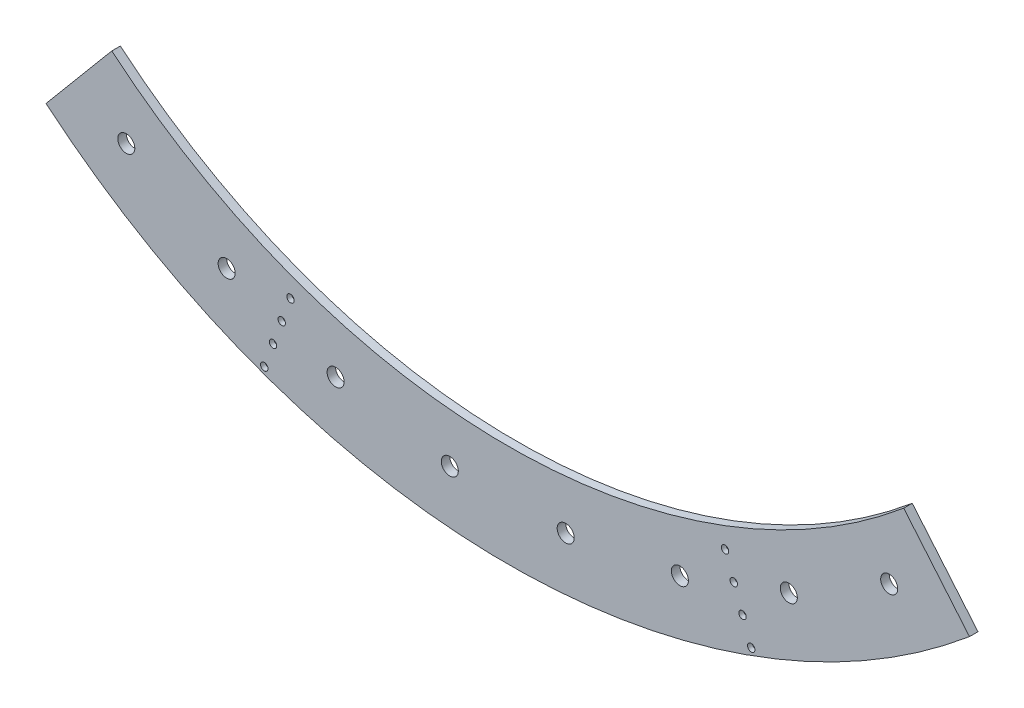
ISO-10303-21;
HEADER;
FILE_DESCRIPTION(('STEP AP214'),'2;1');
FILE_NAME('part.step','',(''),(''),'','','');
FILE_SCHEMA(('AUTOMOTIVE_DESIGN { 1 0 10303 214 1 1 1 1 }'));
ENDSEC;
DATA;
#1=APPLICATION_CONTEXT('core data for automotive mechanical design processes');
#2=APPLICATION_PROTOCOL_DEFINITION('international standard','automotive_design',2000,#1);
#3=PRODUCT_CONTEXT('',#1,'mechanical');
#4=PRODUCT('Part','Part','',(#3));
#5=PRODUCT_RELATED_PRODUCT_CATEGORY('part','',(#4));
#6=PRODUCT_DEFINITION_FORMATION('','',#4);
#7=PRODUCT_DEFINITION_CONTEXT('part definition',#1,'design');
#8=PRODUCT_DEFINITION('design','',#6,#7);
#9=PRODUCT_DEFINITION_SHAPE('','',#8);
#10=(LENGTH_UNIT() NAMED_UNIT(*) SI_UNIT(.MILLI.,.METRE.));
#11=(NAMED_UNIT(*) PLANE_ANGLE_UNIT() SI_UNIT($,.RADIAN.));
#12=(NAMED_UNIT(*) SI_UNIT($,.STERADIAN.) SOLID_ANGLE_UNIT());
#13=UNCERTAINTY_MEASURE_WITH_UNIT(LENGTH_MEASURE(1.E-05),#10,'distance_accuracy_value','');
#14=(GEOMETRIC_REPRESENTATION_CONTEXT(3) GLOBAL_UNCERTAINTY_ASSIGNED_CONTEXT((#13)) GLOBAL_UNIT_ASSIGNED_CONTEXT((#10,
#11,#12)) REPRESENTATION_CONTEXT('',''));
#15=CARTESIAN_POINT('',(0.,0.,0.));
#16=DIRECTION('',(0.,0.,1.));
#17=DIRECTION('',(1.,0.,0.));
#18=AXIS2_PLACEMENT_3D('',#15,#16,#17);
#19=CARTESIAN_POINT('',(0.,0.,12.7));
#20=DIRECTION('',(0.,0.,-1.));
#21=DIRECTION('',(-1.,0.,0.));
#22=AXIS2_PLACEMENT_3D('',#19,#20,#21);
#23=CYLINDRICAL_SURFACE('',#22,917.575);
#24=CARTESIAN_POINT('',(0.,0.,0.));
#25=DIRECTION('',(0.,0.,-1.));
#26=DIRECTION('',(1.,0.,0.));
#27=AXIS2_PLACEMENT_3D('',#24,#25,#26);
#28=CIRCLE('',#27,917.575);
#29=CARTESIAN_POINT('',(589.805840958127,-702.903229894895,0.));
#30=VERTEX_POINT('',#29);
#31=CARTESIAN_POINT('',(-589.805840958127,-702.903229894895,0.));
#32=VERTEX_POINT('',#31);
#33=EDGE_CURVE('E111',#30,#32,#28,.T.);
#34=ORIENTED_EDGE('',*,*,#33,.T.);
#35=DIRECTION('',(0.,0.,-1.));
#36=VECTOR('',#35,1.);
#37=CARTESIAN_POINT('',(-589.805840958127,-702.903229894895,12.7));
#38=LINE('',#37,#36);
#39=CARTESIAN_POINT('',(-589.805840958127,-702.903229894895,12.7));
#40=VERTEX_POINT('',#39);
#41=EDGE_CURVE('E13',#40,#32,#38,.T.);
#42=ORIENTED_EDGE('',*,*,#41,.F.);
#43=CARTESIAN_POINT('',(0.,0.,12.7));
#44=DIRECTION('',(0.,0.,-1.));
#45=DIRECTION('',(1.,0.,0.));
#46=AXIS2_PLACEMENT_3D('',#43,#44,#45);
#47=CIRCLE('',#46,917.575);
#48=CARTESIAN_POINT('',(589.805840958127,-702.903229894895,12.7));
#49=VERTEX_POINT('',#48);
#50=EDGE_CURVE('E99',#49,#40,#47,.T.);
#51=ORIENTED_EDGE('',*,*,#50,.F.);
#52=DIRECTION('',(0.,0.,-1.));
#53=VECTOR('',#52,1.);
#54=CARTESIAN_POINT('',(589.805840958127,-702.903229894895,12.7));
#55=LINE('',#54,#53);
#56=EDGE_CURVE('E107',#49,#30,#55,.T.);
#57=ORIENTED_EDGE('',*,*,#56,.T.);
#58=EDGE_LOOP('',(#34,#42,#51,#57));
#59=FACE_BOUND('',#58,.T.);
#60=ADVANCED_FACE('F48',(#59),#23,.F.);
#61=CARTESIAN_POINT('',(-589.805840958127,-702.903229894895,12.7));
#62=DIRECTION('',(0.766044443118978,-0.64278760968654,0.));
#63=DIRECTION('',(0.64278760968654,0.766044443118978,0.));
#64=AXIS2_PLACEMENT_3D('',#61,#62,#63);
#65=PLANE('',#64);
#66=DIRECTION('',(-0.64278760968654,-0.766044443118978,0.));
#67=VECTOR('',#66,1.);
#68=CARTESIAN_POINT('',(-589.805840958127,-702.903229894895,0.));
#69=LINE('',#68,#67);
#70=CARTESIAN_POINT('',(-687.766672674356,-819.648403026228,0.));
#71=VERTEX_POINT('',#70);
#72=EDGE_CURVE('E103',#32,#71,#69,.T.);
#73=ORIENTED_EDGE('',*,*,#72,.T.);
#74=DIRECTION('',(0.,0.,-1.));
#75=VECTOR('',#74,1.);
#76=CARTESIAN_POINT('',(-687.766672674356,-819.648403026228,12.7));
#77=LINE('',#76,#75);
#78=CARTESIAN_POINT('',(-687.766672674356,-819.648403026228,12.7));
#79=VERTEX_POINT('',#78);
#80=EDGE_CURVE('E56',#79,#71,#77,.T.);
#81=ORIENTED_EDGE('',*,*,#80,.F.);
#82=DIRECTION('',(-0.64278760968654,-0.766044443118978,0.));
#83=VECTOR('',#82,1.);
#84=CARTESIAN_POINT('',(-589.805840958127,-702.903229894895,12.7));
#85=LINE('',#84,#83);
#86=EDGE_CURVE('E94',#40,#79,#85,.T.);
#87=ORIENTED_EDGE('',*,*,#86,.F.);
#88=ORIENTED_EDGE('',*,*,#41,.T.);
#89=EDGE_LOOP('',(#73,#81,#87,#88));
#90=FACE_BOUND('',#89,.T.);
#91=ADVANCED_FACE('F102',(#90),#65,.F.);
#92=CARTESIAN_POINT('',(0.,0.,12.7));
#93=DIRECTION('',(0.,0.,-1.));
#94=DIRECTION('',(-1.,0.,0.));
#95=AXIS2_PLACEMENT_3D('',#92,#93,#94);
#96=CYLINDRICAL_SURFACE('',#95,1069.975);
#97=CARTESIAN_POINT('',(0.,0.,0.));
#98=DIRECTION('',(0.,0.,1.));
#99=DIRECTION('',(1.,0.,0.));
#100=AXIS2_PLACEMENT_3D('',#97,#98,#99);
#101=CIRCLE('',#100,1069.975);
#102=CARTESIAN_POINT('',(687.766672674356,-819.648403026228,0.));
#103=VERTEX_POINT('',#102);
#104=EDGE_CURVE('E81',#71,#103,#101,.T.);
#105=ORIENTED_EDGE('',*,*,#104,.T.);
#106=DIRECTION('',(0.,0.,-1.));
#107=VECTOR('',#106,1.);
#108=CARTESIAN_POINT('',(687.766672674356,-819.648403026228,12.7));
#109=LINE('',#108,#107);
#110=CARTESIAN_POINT('',(687.766672674356,-819.648403026228,12.7));
#111=VERTEX_POINT('',#110);
#112=EDGE_CURVE('E104',#111,#103,#109,.T.);
#113=ORIENTED_EDGE('',*,*,#112,.F.);
#114=CARTESIAN_POINT('',(0.,0.,12.7));
#115=DIRECTION('',(0.,0.,1.));
#116=DIRECTION('',(1.,0.,0.));
#117=AXIS2_PLACEMENT_3D('',#114,#115,#116);
#118=CIRCLE('',#117,1069.975);
#119=EDGE_CURVE('E97',#79,#111,#118,.T.);
#120=ORIENTED_EDGE('',*,*,#119,.F.);
#121=ORIENTED_EDGE('',*,*,#80,.T.);
#122=EDGE_LOOP('',(#105,#113,#120,#121));
#123=FACE_BOUND('',#122,.T.);
#124=ADVANCED_FACE('F105',(#123),#96,.T.);
#125=CARTESIAN_POINT('',(589.805840958127,-702.903229894895,12.7));
#126=DIRECTION('',(-0.766044443118978,-0.64278760968654,0.));
#127=DIRECTION('',(0.64278760968654,-0.766044443118978,0.));
#128=AXIS2_PLACEMENT_3D('',#125,#126,#127);
#129=PLANE('',#128);
#130=DIRECTION('',(-0.64278760968654,0.766044443118978,0.));
#131=VECTOR('',#130,1.);
#132=CARTESIAN_POINT('',(589.805840958127,-702.903229894895,0.));
#133=LINE('',#132,#131);
#134=EDGE_CURVE('E87',#103,#30,#133,.T.);
#135=ORIENTED_EDGE('',*,*,#134,.T.);
#136=ORIENTED_EDGE('',*,*,#56,.F.);
#137=DIRECTION('',(-0.64278760968654,0.766044443118978,0.));
#138=VECTOR('',#137,1.);
#139=CARTESIAN_POINT('',(589.805840958127,-702.903229894895,12.7));
#140=LINE('',#139,#138);
#141=EDGE_CURVE('E64',#111,#49,#140,.T.);
#142=ORIENTED_EDGE('',*,*,#141,.F.);
#143=ORIENTED_EDGE('',*,*,#112,.T.);
#144=EDGE_LOOP('',(#135,#136,#142,#143));
#145=FACE_BOUND('',#144,.T.);
#146=ADVANCED_FACE('F119',(#145),#129,.F.);
#147=CARTESIAN_POINT('',(0.,0.,12.7));
#148=DIRECTION('',(0.,0.,1.));
#149=DIRECTION('',(1.,0.,0.));
#150=AXIS2_PLACEMENT_3D('',#147,#148,#149);
#151=PLANE('',#150);
#152=CARTESIAN_POINT('',(362.695260989706,-996.497039712416,12.7));
#153=DIRECTION('',(0.,0.,1.));
#154=DIRECTION('',(1.,0.,0.));
#155=AXIS2_PLACEMENT_3D('',#152,#153,#154);
#156=CIRCLE('',#155,5.55624999999998);
#157=CARTESIAN_POINT('',(368.251510989706,-996.497039712416,12.7));
#158=VERTEX_POINT('',#157);
#159=EDGE_CURVE('E265',#158,#158,#156,.T.);
#160=ORIENTED_EDGE('',*,*,#159,.F.);
#161=EDGE_LOOP('',(#160));
#162=FACE_BOUND('',#161,.T.);
#163=CARTESIAN_POINT('',(336.63332606829,-924.89246200853,12.7));
#164=DIRECTION('',(0.,0.,1.));
#165=DIRECTION('',(1.,0.,0.));
#166=AXIS2_PLACEMENT_3D('',#163,#164,#165);
#167=CIRCLE('',#166,5.55624999999998);
#168=CARTESIAN_POINT('',(342.18957606829,-924.89246200853,12.7));
#169=VERTEX_POINT('',#168);
#170=EDGE_CURVE('E253',#169,#169,#167,.T.);
#171=ORIENTED_EDGE('',*,*,#170,.F.);
#172=EDGE_LOOP('',(#171));
#173=FACE_BOUND('',#172,.T.);
#174=CARTESIAN_POINT('',(323.602358607582,-889.090173156587,12.7));
#175=DIRECTION('',(0.,0.,1.));
#176=DIRECTION('',(1.,0.,0.));
#177=AXIS2_PLACEMENT_3D('',#174,#175,#176);
#178=CIRCLE('',#177,5.55624999999998);
#179=CARTESIAN_POINT('',(329.158608607582,-889.090173156587,12.7));
#180=VERTEX_POINT('',#179);
#181=EDGE_CURVE('E241',#180,#180,#178,.T.);
#182=ORIENTED_EDGE('',*,*,#181,.F.);
#183=EDGE_LOOP('',(#182));
#184=FACE_BOUND('',#183,.T.);
#185=CARTESIAN_POINT('',(349.664293528998,-960.694750860473,12.7));
#186=DIRECTION('',(0.,0.,1.));
#187=DIRECTION('',(1.,0.,0.));
#188=AXIS2_PLACEMENT_3D('',#185,#186,#187);
#189=CIRCLE('',#188,5.55624999999998);
#190=CARTESIAN_POINT('',(355.220543528998,-960.694750860473,12.7));
#191=VERTEX_POINT('',#190);
#192=EDGE_CURVE('E229',#191,#191,#189,.T.);
#193=ORIENTED_EDGE('',*,*,#192,.F.);
#194=EDGE_LOOP('',(#193));
#195=FACE_BOUND('',#194,.T.);
#196=CARTESIAN_POINT('',(-323.602358607582,-889.090173156587,12.7));
#197=DIRECTION('',(0.,0.,1.));
#198=DIRECTION('',(1.,0.,0.));
#199=AXIS2_PLACEMENT_3D('',#196,#197,#198);
#200=CIRCLE('',#199,5.55624999999998);
#201=CARTESIAN_POINT('',(-318.046108607582,-889.090173156587,12.7));
#202=VERTEX_POINT('',#201);
#203=EDGE_CURVE('E217',#202,#202,#200,.T.);
#204=ORIENTED_EDGE('',*,*,#203,.F.);
#205=EDGE_LOOP('',(#204));
#206=FACE_BOUND('',#205,.T.);
#207=CARTESIAN_POINT('',(-336.63332606829,-924.89246200853,12.7));
#208=DIRECTION('',(0.,0.,1.));
#209=DIRECTION('',(1.,0.,0.));
#210=AXIS2_PLACEMENT_3D('',#207,#208,#209);
#211=CIRCLE('',#210,5.55624999999998);
#212=CARTESIAN_POINT('',(-331.07707606829,-924.89246200853,12.7));
#213=VERTEX_POINT('',#212);
#214=EDGE_CURVE('E205',#213,#213,#211,.T.);
#215=ORIENTED_EDGE('',*,*,#214,.F.);
#216=EDGE_LOOP('',(#215));
#217=FACE_BOUND('',#216,.T.);
#218=CARTESIAN_POINT('',(-349.664293528998,-960.694750860473,12.7));
#219=DIRECTION('',(0.,0.,1.));
#220=DIRECTION('',(1.,0.,0.));
#221=AXIS2_PLACEMENT_3D('',#218,#219,#220);
#222=CIRCLE('',#221,5.55624999999998);
#223=CARTESIAN_POINT('',(-344.108043528998,-960.694750860473,12.7));
#224=VERTEX_POINT('',#223);
#225=EDGE_CURVE('E193',#224,#224,#222,.T.);
#226=ORIENTED_EDGE('',*,*,#225,.F.);
#227=EDGE_LOOP('',(#226));
#228=FACE_BOUND('',#227,.T.);
#229=CARTESIAN_POINT('',(-362.695260989706,-996.497039712416,12.7));
#230=DIRECTION('',(0.,0.,1.));
#231=DIRECTION('',(1.,0.,0.));
#232=AXIS2_PLACEMENT_3D('',#229,#230,#231);
#233=CIRCLE('',#232,5.55624999999998);
#234=CARTESIAN_POINT('',(-357.139010989706,-996.497039712416,12.7));
#235=VERTEX_POINT('',#234);
#236=EDGE_CURVE('E181',#235,#235,#233,.T.);
#237=ORIENTED_EDGE('',*,*,#236,.F.);
#238=EDGE_LOOP('',(#237));
#239=FACE_BOUND('',#238,.T.);
#240=CARTESIAN_POINT('',(568.184817849347,-811.452015072674,12.7));
#241=DIRECTION('',(0.,0.,1.));
#242=DIRECTION('',(1.,0.,0.));
#243=AXIS2_PLACEMENT_3D('',#240,#241,#242);
#244=CIRCLE('',#243,12.7);
#245=CARTESIAN_POINT('',(580.884817849347,-811.452015072674,12.7));
#246=VERTEX_POINT('',#245);
#247=EDGE_CURVE('E169',#246,#246,#244,.T.);
#248=ORIENTED_EDGE('',*,*,#247,.F.);
#249=EDGE_LOOP('',(#248));
#250=FACE_BOUND('',#249,.T.);
#251=CARTESIAN_POINT('',(-418.645650080338,-897.788493838505,12.7));
#252=DIRECTION('',(0.,0.,1.));
#253=DIRECTION('',(1.,0.,0.));
#254=AXIS2_PLACEMENT_3D('',#251,#252,#253);
#255=CIRCLE('',#254,12.7);
#256=CARTESIAN_POINT('',(-405.945650080338,-897.788493838505,12.7));
#257=VERTEX_POINT('',#256);
#258=EDGE_CURVE('E163',#257,#257,#255,.T.);
#259=ORIENTED_EDGE('',*,*,#258,.F.);
#260=EDGE_LOOP('',(#259));
#261=FACE_BOUND('',#260,.T.);
#262=CARTESIAN_POINT('',(418.645650080338,-897.788493838505,12.7));
#263=DIRECTION('',(0.,0.,1.));
#264=DIRECTION('',(1.,0.,0.));
#265=AXIS2_PLACEMENT_3D('',#262,#263,#264);
#266=CIRCLE('',#265,12.7);
#267=CARTESIAN_POINT('',(431.345650080338,-897.788493838505,12.7));
#268=VERTEX_POINT('',#267);
#269=EDGE_CURVE('E157',#268,#268,#266,.T.);
#270=ORIENTED_EDGE('',*,*,#269,.F.);
#271=EDGE_LOOP('',(#270));
#272=FACE_BOUND('',#271,.T.);
#273=CARTESIAN_POINT('',(-568.184817849347,-811.452015072674,12.7));
#274=DIRECTION('',(0.,0.,1.));
#275=DIRECTION('',(1.,0.,0.));
#276=AXIS2_PLACEMENT_3D('',#273,#274,#275);
#277=CIRCLE('',#276,12.7);
#278=CARTESIAN_POINT('',(-555.484817849347,-811.452015072674,12.7));
#279=VERTEX_POINT('',#278);
#280=EDGE_CURVE('E151',#279,#279,#277,.T.);
#281=ORIENTED_EDGE('',*,*,#280,.F.);
#282=EDGE_LOOP('',(#281));
#283=FACE_BOUND('',#282,.T.);
#284=CARTESIAN_POINT('',(256.386146078558,-956.846123521951,12.7));
#285=DIRECTION('',(0.,0.,1.));
#286=DIRECTION('',(1.,0.,0.));
#287=AXIS2_PLACEMENT_3D('',#284,#285,#286);
#288=CIRCLE('',#287,12.7);
#289=CARTESIAN_POINT('',(269.086146078558,-956.846123521951,12.7));
#290=VERTEX_POINT('',#289);
#291=EDGE_CURVE('E145',#290,#290,#288,.T.);
#292=ORIENTED_EDGE('',*,*,#291,.F.);
#293=EDGE_LOOP('',(#292));
#294=FACE_BOUND('',#293,.T.);
#295=CARTESIAN_POINT('',(86.3364787658303,-986.830467929683,12.7));
#296=DIRECTION('',(0.,0.,1.));
#297=DIRECTION('',(1.,0.,0.));
#298=AXIS2_PLACEMENT_3D('',#295,#296,#297);
#299=CIRCLE('',#298,12.7);
#300=CARTESIAN_POINT('',(99.0364787658303,-986.830467929683,12.7));
#301=VERTEX_POINT('',#300);
#302=EDGE_CURVE('E139',#301,#301,#299,.T.);
#303=ORIENTED_EDGE('',*,*,#302,.F.);
#304=EDGE_LOOP('',(#303));
#305=FACE_BOUND('',#304,.T.);
#306=CARTESIAN_POINT('',(-86.3364787658303,-986.830467929683,12.7));
#307=DIRECTION('',(0.,0.,1.));
#308=DIRECTION('',(1.,0.,0.));
#309=AXIS2_PLACEMENT_3D('',#306,#307,#308);
#310=CIRCLE('',#309,12.7);
#311=CARTESIAN_POINT('',(-73.6364787658303,-986.830467929683,12.7));
#312=VERTEX_POINT('',#311);
#313=EDGE_CURVE('E133',#312,#312,#310,.T.);
#314=ORIENTED_EDGE('',*,*,#313,.F.);
#315=EDGE_LOOP('',(#314));
#316=FACE_BOUND('',#315,.T.);
#317=CARTESIAN_POINT('',(-256.386146078558,-956.846123521951,12.7));
#318=DIRECTION('',(0.,0.,1.));
#319=DIRECTION('',(1.,0.,0.));
#320=AXIS2_PLACEMENT_3D('',#317,#318,#319);
#321=CIRCLE('',#320,12.7);
#322=CARTESIAN_POINT('',(-243.686146078558,-956.846123521951,12.7));
#323=VERTEX_POINT('',#322);
#324=EDGE_CURVE('E127',#323,#323,#321,.T.);
#325=ORIENTED_EDGE('',*,*,#324,.F.);
#326=EDGE_LOOP('',(#325));
#327=FACE_BOUND('',#326,.T.);
#328=ORIENTED_EDGE('',*,*,#50,.T.);
#329=ORIENTED_EDGE('',*,*,#86,.T.);
#330=ORIENTED_EDGE('',*,*,#119,.T.);
#331=ORIENTED_EDGE('',*,*,#141,.T.);
#332=EDGE_LOOP('',(#328,#329,#330,#331));
#333=FACE_BOUND('',#332,.T.);
#334=ADVANCED_FACE('F95',(#162,#173,#184,#195,#206,#217,#228,#239,#250,#261,#272,#283,#294,#305,
#316,#327,#333),#151,.T.);
#335=CARTESIAN_POINT('',(0.,0.,0.));
#336=DIRECTION('',(0.,0.,1.));
#337=DIRECTION('',(1.,0.,0.));
#338=AXIS2_PLACEMENT_3D('',#335,#336,#337);
#339=PLANE('',#338);
#340=CARTESIAN_POINT('',(362.695260989706,-996.497039712416,0.));
#341=DIRECTION('',(0.,0.,1.));
#342=DIRECTION('',(1.,0.,0.));
#343=AXIS2_PLACEMENT_3D('',#340,#341,#342);
#344=CIRCLE('',#343,3.26389999999999);
#345=CARTESIAN_POINT('',(365.959160989706,-996.497039712416,0.));
#346=VERTEX_POINT('',#345);
#347=EDGE_CURVE('E256',#346,#346,#344,.T.);
#348=ORIENTED_EDGE('',*,*,#347,.T.);
#349=EDGE_LOOP('',(#348));
#350=FACE_BOUND('',#349,.T.);
#351=CARTESIAN_POINT('',(336.63332606829,-924.89246200853,0.));
#352=DIRECTION('',(0.,0.,1.));
#353=DIRECTION('',(1.,0.,0.));
#354=AXIS2_PLACEMENT_3D('',#351,#352,#353);
#355=CIRCLE('',#354,3.26389999999999);
#356=CARTESIAN_POINT('',(339.89722606829,-924.89246200853,0.));
#357=VERTEX_POINT('',#356);
#358=EDGE_CURVE('E244',#357,#357,#355,.T.);
#359=ORIENTED_EDGE('',*,*,#358,.T.);
#360=EDGE_LOOP('',(#359));
#361=FACE_BOUND('',#360,.T.);
#362=CARTESIAN_POINT('',(323.602358607582,-889.090173156587,0.));
#363=DIRECTION('',(0.,0.,1.));
#364=DIRECTION('',(1.,0.,0.));
#365=AXIS2_PLACEMENT_3D('',#362,#363,#364);
#366=CIRCLE('',#365,3.26389999999999);
#367=CARTESIAN_POINT('',(326.866258607582,-889.090173156587,0.));
#368=VERTEX_POINT('',#367);
#369=EDGE_CURVE('E232',#368,#368,#366,.T.);
#370=ORIENTED_EDGE('',*,*,#369,.T.);
#371=EDGE_LOOP('',(#370));
#372=FACE_BOUND('',#371,.T.);
#373=CARTESIAN_POINT('',(349.664293528998,-960.694750860473,0.));
#374=DIRECTION('',(0.,0.,1.));
#375=DIRECTION('',(1.,0.,0.));
#376=AXIS2_PLACEMENT_3D('',#373,#374,#375);
#377=CIRCLE('',#376,3.26389999999999);
#378=CARTESIAN_POINT('',(352.928193528998,-960.694750860473,0.));
#379=VERTEX_POINT('',#378);
#380=EDGE_CURVE('E220',#379,#379,#377,.T.);
#381=ORIENTED_EDGE('',*,*,#380,.T.);
#382=EDGE_LOOP('',(#381));
#383=FACE_BOUND('',#382,.T.);
#384=CARTESIAN_POINT('',(-323.602358607582,-889.090173156587,0.));
#385=DIRECTION('',(0.,0.,1.));
#386=DIRECTION('',(1.,0.,0.));
#387=AXIS2_PLACEMENT_3D('',#384,#385,#386);
#388=CIRCLE('',#387,3.26389999999999);
#389=CARTESIAN_POINT('',(-320.338458607582,-889.090173156587,0.));
#390=VERTEX_POINT('',#389);
#391=EDGE_CURVE('E208',#390,#390,#388,.T.);
#392=ORIENTED_EDGE('',*,*,#391,.T.);
#393=EDGE_LOOP('',(#392));
#394=FACE_BOUND('',#393,.T.);
#395=CARTESIAN_POINT('',(-336.63332606829,-924.89246200853,0.));
#396=DIRECTION('',(0.,0.,1.));
#397=DIRECTION('',(1.,0.,0.));
#398=AXIS2_PLACEMENT_3D('',#395,#396,#397);
#399=CIRCLE('',#398,3.26389999999999);
#400=CARTESIAN_POINT('',(-333.36942606829,-924.89246200853,0.));
#401=VERTEX_POINT('',#400);
#402=EDGE_CURVE('E196',#401,#401,#399,.T.);
#403=ORIENTED_EDGE('',*,*,#402,.T.);
#404=EDGE_LOOP('',(#403));
#405=FACE_BOUND('',#404,.T.);
#406=CARTESIAN_POINT('',(-349.664293528998,-960.694750860473,0.));
#407=DIRECTION('',(0.,0.,1.));
#408=DIRECTION('',(1.,0.,0.));
#409=AXIS2_PLACEMENT_3D('',#406,#407,#408);
#410=CIRCLE('',#409,3.26389999999999);
#411=CARTESIAN_POINT('',(-346.400393528998,-960.694750860473,0.));
#412=VERTEX_POINT('',#411);
#413=EDGE_CURVE('E184',#412,#412,#410,.T.);
#414=ORIENTED_EDGE('',*,*,#413,.T.);
#415=EDGE_LOOP('',(#414));
#416=FACE_BOUND('',#415,.T.);
#417=CARTESIAN_POINT('',(-362.695260989706,-996.497039712416,0.));
#418=DIRECTION('',(0.,0.,1.));
#419=DIRECTION('',(1.,0.,0.));
#420=AXIS2_PLACEMENT_3D('',#417,#418,#419);
#421=CIRCLE('',#420,3.26389999999999);
#422=CARTESIAN_POINT('',(-359.431360989706,-996.497039712416,0.));
#423=VERTEX_POINT('',#422);
#424=EDGE_CURVE('E172',#423,#423,#421,.T.);
#425=ORIENTED_EDGE('',*,*,#424,.T.);
#426=EDGE_LOOP('',(#425));
#427=FACE_BOUND('',#426,.T.);
#428=CARTESIAN_POINT('',(568.184817849347,-811.452015072674,0.));
#429=DIRECTION('',(0.,0.,1.));
#430=DIRECTION('',(1.,0.,0.));
#431=AXIS2_PLACEMENT_3D('',#428,#429,#430);
#432=CIRCLE('',#431,12.7);
#433=CARTESIAN_POINT('',(580.884817849347,-811.452015072674,0.));
#434=VERTEX_POINT('',#433);
#435=EDGE_CURVE('E166',#434,#434,#432,.T.);
#436=ORIENTED_EDGE('',*,*,#435,.T.);
#437=EDGE_LOOP('',(#436));
#438=FACE_BOUND('',#437,.T.);
#439=CARTESIAN_POINT('',(-418.645650080338,-897.788493838505,0.));
#440=DIRECTION('',(0.,0.,1.));
#441=DIRECTION('',(1.,0.,0.));
#442=AXIS2_PLACEMENT_3D('',#439,#440,#441);
#443=CIRCLE('',#442,12.7);
#444=CARTESIAN_POINT('',(-405.945650080338,-897.788493838505,0.));
#445=VERTEX_POINT('',#444);
#446=EDGE_CURVE('E160',#445,#445,#443,.T.);
#447=ORIENTED_EDGE('',*,*,#446,.T.);
#448=EDGE_LOOP('',(#447));
#449=FACE_BOUND('',#448,.T.);
#450=CARTESIAN_POINT('',(418.645650080338,-897.788493838505,0.));
#451=DIRECTION('',(0.,0.,1.));
#452=DIRECTION('',(1.,0.,0.));
#453=AXIS2_PLACEMENT_3D('',#450,#451,#452);
#454=CIRCLE('',#453,12.7);
#455=CARTESIAN_POINT('',(431.345650080338,-897.788493838505,0.));
#456=VERTEX_POINT('',#455);
#457=EDGE_CURVE('E154',#456,#456,#454,.T.);
#458=ORIENTED_EDGE('',*,*,#457,.T.);
#459=EDGE_LOOP('',(#458));
#460=FACE_BOUND('',#459,.T.);
#461=CARTESIAN_POINT('',(-568.184817849347,-811.452015072674,0.));
#462=DIRECTION('',(0.,0.,1.));
#463=DIRECTION('',(1.,0.,0.));
#464=AXIS2_PLACEMENT_3D('',#461,#462,#463);
#465=CIRCLE('',#464,12.7);
#466=CARTESIAN_POINT('',(-555.484817849347,-811.452015072674,0.));
#467=VERTEX_POINT('',#466);
#468=EDGE_CURVE('E148',#467,#467,#465,.T.);
#469=ORIENTED_EDGE('',*,*,#468,.T.);
#470=EDGE_LOOP('',(#469));
#471=FACE_BOUND('',#470,.T.);
#472=CARTESIAN_POINT('',(256.386146078558,-956.846123521951,0.));
#473=DIRECTION('',(0.,0.,1.));
#474=DIRECTION('',(1.,0.,0.));
#475=AXIS2_PLACEMENT_3D('',#472,#473,#474);
#476=CIRCLE('',#475,12.7);
#477=CARTESIAN_POINT('',(269.086146078558,-956.846123521951,0.));
#478=VERTEX_POINT('',#477);
#479=EDGE_CURVE('E142',#478,#478,#476,.T.);
#480=ORIENTED_EDGE('',*,*,#479,.T.);
#481=EDGE_LOOP('',(#480));
#482=FACE_BOUND('',#481,.T.);
#483=CARTESIAN_POINT('',(86.3364787658303,-986.830467929683,0.));
#484=DIRECTION('',(0.,0.,1.));
#485=DIRECTION('',(1.,0.,0.));
#486=AXIS2_PLACEMENT_3D('',#483,#484,#485);
#487=CIRCLE('',#486,12.7);
#488=CARTESIAN_POINT('',(99.0364787658303,-986.830467929683,0.));
#489=VERTEX_POINT('',#488);
#490=EDGE_CURVE('E136',#489,#489,#487,.T.);
#491=ORIENTED_EDGE('',*,*,#490,.T.);
#492=EDGE_LOOP('',(#491));
#493=FACE_BOUND('',#492,.T.);
#494=CARTESIAN_POINT('',(-86.3364787658303,-986.830467929683,0.));
#495=DIRECTION('',(0.,0.,1.));
#496=DIRECTION('',(1.,0.,0.));
#497=AXIS2_PLACEMENT_3D('',#494,#495,#496);
#498=CIRCLE('',#497,12.7);
#499=CARTESIAN_POINT('',(-73.6364787658303,-986.830467929683,0.));
#500=VERTEX_POINT('',#499);
#501=EDGE_CURVE('E130',#500,#500,#498,.T.);
#502=ORIENTED_EDGE('',*,*,#501,.T.);
#503=EDGE_LOOP('',(#502));
#504=FACE_BOUND('',#503,.T.);
#505=CARTESIAN_POINT('',(-256.386146078558,-956.846123521951,0.));
#506=DIRECTION('',(0.,0.,1.));
#507=DIRECTION('',(1.,0.,0.));
#508=AXIS2_PLACEMENT_3D('',#505,#506,#507);
#509=CIRCLE('',#508,12.7);
#510=CARTESIAN_POINT('',(-243.686146078558,-956.846123521951,0.));
#511=VERTEX_POINT('',#510);
#512=EDGE_CURVE('E114',#511,#511,#509,.T.);
#513=ORIENTED_EDGE('',*,*,#512,.T.);
#514=EDGE_LOOP('',(#513));
#515=FACE_BOUND('',#514,.T.);
#516=ORIENTED_EDGE('',*,*,#33,.F.);
#517=ORIENTED_EDGE('',*,*,#134,.F.);
#518=ORIENTED_EDGE('',*,*,#104,.F.);
#519=ORIENTED_EDGE('',*,*,#72,.F.);
#520=EDGE_LOOP('',(#516,#517,#518,#519));
#521=FACE_BOUND('',#520,.T.);
#522=ADVANCED_FACE('F122',(#350,#361,#372,#383,#394,#405,#416,#427,#438,#449,#460,#471,#482,
#493,#504,#515,#521),#339,.F.);
#523=CARTESIAN_POINT('',(-256.386146078558,-956.846123521951,12.7));
#524=DIRECTION('',(0.,0.,1.));
#525=DIRECTION('',(1.,0.,0.));
#526=AXIS2_PLACEMENT_3D('',#523,#524,#525);
#527=CYLINDRICAL_SURFACE('',#526,12.7);
#528=ORIENTED_EDGE('',*,*,#512,.F.);
#529=EDGE_LOOP('',(#528));
#530=FACE_BOUND('',#529,.T.);
#531=ORIENTED_EDGE('',*,*,#324,.T.);
#532=EDGE_LOOP('',(#531));
#533=FACE_BOUND('',#532,.T.);
#534=ADVANCED_FACE('F304',(#530,#533),#527,.F.);
#535=CARTESIAN_POINT('',(-86.3364787658303,-986.830467929683,12.7));
#536=DIRECTION('',(0.,0.,1.));
#537=DIRECTION('',(1.,0.,0.));
#538=AXIS2_PLACEMENT_3D('',#535,#536,#537);
#539=CYLINDRICAL_SURFACE('',#538,12.7);
#540=ORIENTED_EDGE('',*,*,#501,.F.);
#541=EDGE_LOOP('',(#540));
#542=FACE_BOUND('',#541,.T.);
#543=ORIENTED_EDGE('',*,*,#313,.T.);
#544=EDGE_LOOP('',(#543));
#545=FACE_BOUND('',#544,.T.);
#546=ADVANCED_FACE('F306',(#542,#545),#539,.F.);
#547=CARTESIAN_POINT('',(86.3364787658303,-986.830467929683,12.7));
#548=DIRECTION('',(0.,0.,1.));
#549=DIRECTION('',(1.,0.,0.));
#550=AXIS2_PLACEMENT_3D('',#547,#548,#549);
#551=CYLINDRICAL_SURFACE('',#550,12.7);
#552=ORIENTED_EDGE('',*,*,#490,.F.);
#553=EDGE_LOOP('',(#552));
#554=FACE_BOUND('',#553,.T.);
#555=ORIENTED_EDGE('',*,*,#302,.T.);
#556=EDGE_LOOP('',(#555));
#557=FACE_BOUND('',#556,.T.);
#558=ADVANCED_FACE('F313',(#554,#557),#551,.F.);
#559=CARTESIAN_POINT('',(256.386146078558,-956.846123521951,12.7));
#560=DIRECTION('',(0.,0.,1.));
#561=DIRECTION('',(1.,0.,0.));
#562=AXIS2_PLACEMENT_3D('',#559,#560,#561);
#563=CYLINDRICAL_SURFACE('',#562,12.7);
#564=ORIENTED_EDGE('',*,*,#479,.F.);
#565=EDGE_LOOP('',(#564));
#566=FACE_BOUND('',#565,.T.);
#567=ORIENTED_EDGE('',*,*,#291,.T.);
#568=EDGE_LOOP('',(#567));
#569=FACE_BOUND('',#568,.T.);
#570=ADVANCED_FACE('F604',(#566,#569),#563,.F.);
#571=CARTESIAN_POINT('',(-568.184817849347,-811.452015072674,12.7));
#572=DIRECTION('',(0.,0.,1.));
#573=DIRECTION('',(1.,0.,0.));
#574=AXIS2_PLACEMENT_3D('',#571,#572,#573);
#575=CYLINDRICAL_SURFACE('',#574,12.7);
#576=ORIENTED_EDGE('',*,*,#468,.F.);
#577=EDGE_LOOP('',(#576));
#578=FACE_BOUND('',#577,.T.);
#579=ORIENTED_EDGE('',*,*,#280,.T.);
#580=EDGE_LOOP('',(#579));
#581=FACE_BOUND('',#580,.T.);
#582=ADVANCED_FACE('F600',(#578,#581),#575,.F.);
#583=CARTESIAN_POINT('',(418.645650080338,-897.788493838505,12.7));
#584=DIRECTION('',(0.,0.,1.));
#585=DIRECTION('',(1.,0.,0.));
#586=AXIS2_PLACEMENT_3D('',#583,#584,#585);
#587=CYLINDRICAL_SURFACE('',#586,12.7);
#588=ORIENTED_EDGE('',*,*,#457,.F.);
#589=EDGE_LOOP('',(#588));
#590=FACE_BOUND('',#589,.T.);
#591=ORIENTED_EDGE('',*,*,#269,.T.);
#592=EDGE_LOOP('',(#591));
#593=FACE_BOUND('',#592,.T.);
#594=ADVANCED_FACE('F596',(#590,#593),#587,.F.);
#595=CARTESIAN_POINT('',(-418.645650080338,-897.788493838505,12.7));
#596=DIRECTION('',(0.,0.,1.));
#597=DIRECTION('',(1.,0.,0.));
#598=AXIS2_PLACEMENT_3D('',#595,#596,#597);
#599=CYLINDRICAL_SURFACE('',#598,12.7);
#600=ORIENTED_EDGE('',*,*,#446,.F.);
#601=EDGE_LOOP('',(#600));
#602=FACE_BOUND('',#601,.T.);
#603=ORIENTED_EDGE('',*,*,#258,.T.);
#604=EDGE_LOOP('',(#603));
#605=FACE_BOUND('',#604,.T.);
#606=ADVANCED_FACE('F592',(#602,#605),#599,.F.);
#607=CARTESIAN_POINT('',(568.184817849347,-811.452015072674,12.7));
#608=DIRECTION('',(0.,0.,1.));
#609=DIRECTION('',(1.,0.,0.));
#610=AXIS2_PLACEMENT_3D('',#607,#608,#609);
#611=CYLINDRICAL_SURFACE('',#610,12.7);
#612=ORIENTED_EDGE('',*,*,#435,.F.);
#613=EDGE_LOOP('',(#612));
#614=FACE_BOUND('',#613,.T.);
#615=ORIENTED_EDGE('',*,*,#247,.T.);
#616=EDGE_LOOP('',(#615));
#617=FACE_BOUND('',#616,.T.);
#618=ADVANCED_FACE('F354',(#614,#617),#611,.F.);
#619=CARTESIAN_POINT('',(-362.695260989706,-996.497039712416,12.7));
#620=DIRECTION('',(0.,0.,1.));
#621=DIRECTION('',(1.,0.,0.));
#622=AXIS2_PLACEMENT_3D('',#619,#620,#621);
#623=CYLINDRICAL_SURFACE('',#622,3.26389999999999);
#624=ORIENTED_EDGE('',*,*,#424,.F.);
#625=EDGE_LOOP('',(#624));
#626=FACE_BOUND('',#625,.T.);
#627=CARTESIAN_POINT('',(-362.695260989706,-996.497039712416,5.588));
#628=DIRECTION('',(0.,0.,1.));
#629=DIRECTION('',(1.,0.,0.));
#630=AXIS2_PLACEMENT_3D('',#627,#628,#629);
#631=CIRCLE('',#630,3.26389999999999);
#632=CARTESIAN_POINT('',(-359.431360989706,-996.497039712416,5.588));
#633=VERTEX_POINT('',#632);
#634=EDGE_CURVE('E175',#633,#633,#631,.T.);
#635=ORIENTED_EDGE('',*,*,#634,.T.);
#636=EDGE_LOOP('',(#635));
#637=FACE_BOUND('',#636,.T.);
#638=ADVANCED_FACE('F348',(#626,#637),#623,.F.);
#639=CARTESIAN_POINT('',(-359.431360989706,-996.497039712416,5.588));
#640=DIRECTION('',(0.,0.,-1.));
#641=DIRECTION('',(-1.,0.,0.));
#642=AXIS2_PLACEMENT_3D('',#639,#640,#641);
#643=PLANE('',#642);
#644=ORIENTED_EDGE('',*,*,#634,.F.);
#645=EDGE_LOOP('',(#644));
#646=FACE_BOUND('',#645,.T.);
#647=CARTESIAN_POINT('',(-362.695260989706,-996.497039712416,5.588));
#648=DIRECTION('',(0.,0.,1.));
#649=DIRECTION('',(1.,0.,0.));
#650=AXIS2_PLACEMENT_3D('',#647,#648,#649);
#651=CIRCLE('',#650,5.55624999999998);
#652=CARTESIAN_POINT('',(-357.139010989706,-996.497039712416,5.588));
#653=VERTEX_POINT('',#652);
#654=EDGE_CURVE('E178',#653,#653,#651,.T.);
#655=ORIENTED_EDGE('',*,*,#654,.T.);
#656=EDGE_LOOP('',(#655));
#657=FACE_BOUND('',#656,.T.);
#658=ADVANCED_FACE('F353',(#646,#657),#643,.F.);
#659=CARTESIAN_POINT('',(-362.695260989706,-996.497039712416,12.7));
#660=DIRECTION('',(0.,0.,1.));
#661=DIRECTION('',(1.,0.,0.));
#662=AXIS2_PLACEMENT_3D('',#659,#660,#661);
#663=CYLINDRICAL_SURFACE('',#662,5.55624999999998);
#664=ORIENTED_EDGE('',*,*,#654,.F.);
#665=EDGE_LOOP('',(#664));
#666=FACE_BOUND('',#665,.T.);
#667=ORIENTED_EDGE('',*,*,#236,.T.);
#668=EDGE_LOOP('',(#667));
#669=FACE_BOUND('',#668,.T.);
#670=ADVANCED_FACE('F366',(#666,#669),#663,.F.);
#671=CARTESIAN_POINT('',(-349.664293528998,-960.694750860473,12.7));
#672=DIRECTION('',(0.,0.,1.));
#673=DIRECTION('',(1.,0.,0.));
#674=AXIS2_PLACEMENT_3D('',#671,#672,#673);
#675=CYLINDRICAL_SURFACE('',#674,3.26389999999999);
#676=ORIENTED_EDGE('',*,*,#413,.F.);
#677=EDGE_LOOP('',(#676));
#678=FACE_BOUND('',#677,.T.);
#679=CARTESIAN_POINT('',(-349.664293528998,-960.694750860473,5.588));
#680=DIRECTION('',(0.,0.,1.));
#681=DIRECTION('',(1.,0.,0.));
#682=AXIS2_PLACEMENT_3D('',#679,#680,#681);
#683=CIRCLE('',#682,3.26389999999999);
#684=CARTESIAN_POINT('',(-346.400393528998,-960.694750860473,5.588));
#685=VERTEX_POINT('',#684);
#686=EDGE_CURVE('E187',#685,#685,#683,.T.);
#687=ORIENTED_EDGE('',*,*,#686,.T.);
#688=EDGE_LOOP('',(#687));
#689=FACE_BOUND('',#688,.T.);
#690=ADVANCED_FACE('F376',(#678,#689),#675,.F.);
#691=CARTESIAN_POINT('',(-346.400393528998,-960.694750860473,5.588));
#692=DIRECTION('',(0.,0.,-1.));
#693=DIRECTION('',(-1.,0.,0.));
#694=AXIS2_PLACEMENT_3D('',#691,#692,#693);
#695=PLANE('',#694);
#696=ORIENTED_EDGE('',*,*,#686,.F.);
#697=EDGE_LOOP('',(#696));
#698=FACE_BOUND('',#697,.T.);
#699=CARTESIAN_POINT('',(-349.664293528998,-960.694750860473,5.588));
#700=DIRECTION('',(0.,0.,1.));
#701=DIRECTION('',(1.,0.,0.));
#702=AXIS2_PLACEMENT_3D('',#699,#700,#701);
#703=CIRCLE('',#702,5.55624999999998);
#704=CARTESIAN_POINT('',(-344.108043528998,-960.694750860473,5.588));
#705=VERTEX_POINT('',#704);
#706=EDGE_CURVE('E190',#705,#705,#703,.T.);
#707=ORIENTED_EDGE('',*,*,#706,.T.);
#708=EDGE_LOOP('',(#707));
#709=FACE_BOUND('',#708,.T.);
#710=ADVANCED_FACE('F386',(#698,#709),#695,.F.);
#711=CARTESIAN_POINT('',(-349.664293528998,-960.694750860473,12.7));
#712=DIRECTION('',(0.,0.,1.));
#713=DIRECTION('',(1.,0.,0.));
#714=AXIS2_PLACEMENT_3D('',#711,#712,#713);
#715=CYLINDRICAL_SURFACE('',#714,5.55624999999998);
#716=ORIENTED_EDGE('',*,*,#706,.F.);
#717=EDGE_LOOP('',(#716));
#718=FACE_BOUND('',#717,.T.);
#719=ORIENTED_EDGE('',*,*,#225,.T.);
#720=EDGE_LOOP('',(#719));
#721=FACE_BOUND('',#720,.T.);
#722=ADVANCED_FACE('F396',(#718,#721),#715,.F.);
#723=CARTESIAN_POINT('',(-336.63332606829,-924.89246200853,12.7));
#724=DIRECTION('',(0.,0.,1.));
#725=DIRECTION('',(1.,0.,0.));
#726=AXIS2_PLACEMENT_3D('',#723,#724,#725);
#727=CYLINDRICAL_SURFACE('',#726,3.26389999999999);
#728=ORIENTED_EDGE('',*,*,#402,.F.);
#729=EDGE_LOOP('',(#728));
#730=FACE_BOUND('',#729,.T.);
#731=CARTESIAN_POINT('',(-336.63332606829,-924.89246200853,5.588));
#732=DIRECTION('',(0.,0.,1.));
#733=DIRECTION('',(1.,0.,0.));
#734=AXIS2_PLACEMENT_3D('',#731,#732,#733);
#735=CIRCLE('',#734,3.26389999999999);
#736=CARTESIAN_POINT('',(-333.36942606829,-924.89246200853,5.588));
#737=VERTEX_POINT('',#736);
#738=EDGE_CURVE('E199',#737,#737,#735,.T.);
#739=ORIENTED_EDGE('',*,*,#738,.T.);
#740=EDGE_LOOP('',(#739));
#741=FACE_BOUND('',#740,.T.);
#742=ADVANCED_FACE('F406',(#730,#741),#727,.F.);
#743=CARTESIAN_POINT('',(-333.36942606829,-924.89246200853,5.588));
#744=DIRECTION('',(0.,0.,-1.));
#745=DIRECTION('',(-1.,0.,0.));
#746=AXIS2_PLACEMENT_3D('',#743,#744,#745);
#747=PLANE('',#746);
#748=ORIENTED_EDGE('',*,*,#738,.F.);
#749=EDGE_LOOP('',(#748));
#750=FACE_BOUND('',#749,.T.);
#751=CARTESIAN_POINT('',(-336.63332606829,-924.89246200853,5.588));
#752=DIRECTION('',(0.,0.,1.));
#753=DIRECTION('',(1.,0.,0.));
#754=AXIS2_PLACEMENT_3D('',#751,#752,#753);
#755=CIRCLE('',#754,5.55624999999998);
#756=CARTESIAN_POINT('',(-331.07707606829,-924.89246200853,5.588));
#757=VERTEX_POINT('',#756);
#758=EDGE_CURVE('E202',#757,#757,#755,.T.);
#759=ORIENTED_EDGE('',*,*,#758,.T.);
#760=EDGE_LOOP('',(#759));
#761=FACE_BOUND('',#760,.T.);
#762=ADVANCED_FACE('F416',(#750,#761),#747,.F.);
#763=CARTESIAN_POINT('',(-336.63332606829,-924.89246200853,12.7));
#764=DIRECTION('',(0.,0.,1.));
#765=DIRECTION('',(1.,0.,0.));
#766=AXIS2_PLACEMENT_3D('',#763,#764,#765);
#767=CYLINDRICAL_SURFACE('',#766,5.55624999999998);
#768=ORIENTED_EDGE('',*,*,#758,.F.);
#769=EDGE_LOOP('',(#768));
#770=FACE_BOUND('',#769,.T.);
#771=ORIENTED_EDGE('',*,*,#214,.T.);
#772=EDGE_LOOP('',(#771));
#773=FACE_BOUND('',#772,.T.);
#774=ADVANCED_FACE('F426',(#770,#773),#767,.F.);
#775=CARTESIAN_POINT('',(-323.602358607582,-889.090173156587,12.7));
#776=DIRECTION('',(0.,0.,1.));
#777=DIRECTION('',(1.,0.,0.));
#778=AXIS2_PLACEMENT_3D('',#775,#776,#777);
#779=CYLINDRICAL_SURFACE('',#778,3.26389999999999);
#780=ORIENTED_EDGE('',*,*,#391,.F.);
#781=EDGE_LOOP('',(#780));
#782=FACE_BOUND('',#781,.T.);
#783=CARTESIAN_POINT('',(-323.602358607582,-889.090173156587,5.588));
#784=DIRECTION('',(0.,0.,1.));
#785=DIRECTION('',(1.,0.,0.));
#786=AXIS2_PLACEMENT_3D('',#783,#784,#785);
#787=CIRCLE('',#786,3.26389999999999);
#788=CARTESIAN_POINT('',(-320.338458607582,-889.090173156587,5.588));
#789=VERTEX_POINT('',#788);
#790=EDGE_CURVE('E211',#789,#789,#787,.T.);
#791=ORIENTED_EDGE('',*,*,#790,.T.);
#792=EDGE_LOOP('',(#791));
#793=FACE_BOUND('',#792,.T.);
#794=ADVANCED_FACE('F436',(#782,#793),#779,.F.);
#795=CARTESIAN_POINT('',(-320.338458607582,-889.090173156587,5.588));
#796=DIRECTION('',(0.,0.,-1.));
#797=DIRECTION('',(-1.,0.,0.));
#798=AXIS2_PLACEMENT_3D('',#795,#796,#797);
#799=PLANE('',#798);
#800=ORIENTED_EDGE('',*,*,#790,.F.);
#801=EDGE_LOOP('',(#800));
#802=FACE_BOUND('',#801,.T.);
#803=CARTESIAN_POINT('',(-323.602358607582,-889.090173156587,5.588));
#804=DIRECTION('',(0.,0.,1.));
#805=DIRECTION('',(1.,0.,0.));
#806=AXIS2_PLACEMENT_3D('',#803,#804,#805);
#807=CIRCLE('',#806,5.55624999999998);
#808=CARTESIAN_POINT('',(-318.046108607582,-889.090173156587,5.588));
#809=VERTEX_POINT('',#808);
#810=EDGE_CURVE('E214',#809,#809,#807,.T.);
#811=ORIENTED_EDGE('',*,*,#810,.T.);
#812=EDGE_LOOP('',(#811));
#813=FACE_BOUND('',#812,.T.);
#814=ADVANCED_FACE('F446',(#802,#813),#799,.F.);
#815=CARTESIAN_POINT('',(-323.602358607582,-889.090173156587,12.7));
#816=DIRECTION('',(0.,0.,1.));
#817=DIRECTION('',(1.,0.,0.));
#818=AXIS2_PLACEMENT_3D('',#815,#816,#817);
#819=CYLINDRICAL_SURFACE('',#818,5.55624999999998);
#820=ORIENTED_EDGE('',*,*,#810,.F.);
#821=EDGE_LOOP('',(#820));
#822=FACE_BOUND('',#821,.T.);
#823=ORIENTED_EDGE('',*,*,#203,.T.);
#824=EDGE_LOOP('',(#823));
#825=FACE_BOUND('',#824,.T.);
#826=ADVANCED_FACE('F456',(#822,#825),#819,.F.);
#827=CARTESIAN_POINT('',(349.664293528998,-960.694750860473,12.7));
#828=DIRECTION('',(0.,0.,1.));
#829=DIRECTION('',(1.,0.,0.));
#830=AXIS2_PLACEMENT_3D('',#827,#828,#829);
#831=CYLINDRICAL_SURFACE('',#830,3.26389999999999);
#832=ORIENTED_EDGE('',*,*,#380,.F.);
#833=EDGE_LOOP('',(#832));
#834=FACE_BOUND('',#833,.T.);
#835=CARTESIAN_POINT('',(349.664293528998,-960.694750860473,5.588));
#836=DIRECTION('',(0.,0.,1.));
#837=DIRECTION('',(1.,0.,0.));
#838=AXIS2_PLACEMENT_3D('',#835,#836,#837);
#839=CIRCLE('',#838,3.26389999999999);
#840=CARTESIAN_POINT('',(352.928193528998,-960.694750860473,5.588));
#841=VERTEX_POINT('',#840);
#842=EDGE_CURVE('E223',#841,#841,#839,.T.);
#843=ORIENTED_EDGE('',*,*,#842,.T.);
#844=EDGE_LOOP('',(#843));
#845=FACE_BOUND('',#844,.T.);
#846=ADVANCED_FACE('F466',(#834,#845),#831,.F.);
#847=CARTESIAN_POINT('',(352.928193528998,-960.694750860473,5.588));
#848=DIRECTION('',(0.,0.,-1.));
#849=DIRECTION('',(-1.,0.,0.));
#850=AXIS2_PLACEMENT_3D('',#847,#848,#849);
#851=PLANE('',#850);
#852=ORIENTED_EDGE('',*,*,#842,.F.);
#853=EDGE_LOOP('',(#852));
#854=FACE_BOUND('',#853,.T.);
#855=CARTESIAN_POINT('',(349.664293528998,-960.694750860473,5.588));
#856=DIRECTION('',(0.,0.,1.));
#857=DIRECTION('',(1.,0.,0.));
#858=AXIS2_PLACEMENT_3D('',#855,#856,#857);
#859=CIRCLE('',#858,5.55624999999998);
#860=CARTESIAN_POINT('',(355.220543528998,-960.694750860473,5.588));
#861=VERTEX_POINT('',#860);
#862=EDGE_CURVE('E226',#861,#861,#859,.T.);
#863=ORIENTED_EDGE('',*,*,#862,.T.);
#864=EDGE_LOOP('',(#863));
#865=FACE_BOUND('',#864,.T.);
#866=ADVANCED_FACE('F476',(#854,#865),#851,.F.);
#867=CARTESIAN_POINT('',(349.664293528998,-960.694750860473,12.7));
#868=DIRECTION('',(0.,0.,1.));
#869=DIRECTION('',(1.,0.,0.));
#870=AXIS2_PLACEMENT_3D('',#867,#868,#869);
#871=CYLINDRICAL_SURFACE('',#870,5.55624999999998);
#872=ORIENTED_EDGE('',*,*,#862,.F.);
#873=EDGE_LOOP('',(#872));
#874=FACE_BOUND('',#873,.T.);
#875=ORIENTED_EDGE('',*,*,#192,.T.);
#876=EDGE_LOOP('',(#875));
#877=FACE_BOUND('',#876,.T.);
#878=ADVANCED_FACE('F486',(#874,#877),#871,.F.);
#879=CARTESIAN_POINT('',(323.602358607582,-889.090173156587,12.7));
#880=DIRECTION('',(0.,0.,1.));
#881=DIRECTION('',(1.,0.,0.));
#882=AXIS2_PLACEMENT_3D('',#879,#880,#881);
#883=CYLINDRICAL_SURFACE('',#882,3.26389999999999);
#884=ORIENTED_EDGE('',*,*,#369,.F.);
#885=EDGE_LOOP('',(#884));
#886=FACE_BOUND('',#885,.T.);
#887=CARTESIAN_POINT('',(323.602358607582,-889.090173156587,5.588));
#888=DIRECTION('',(0.,0.,1.));
#889=DIRECTION('',(1.,0.,0.));
#890=AXIS2_PLACEMENT_3D('',#887,#888,#889);
#891=CIRCLE('',#890,3.26389999999999);
#892=CARTESIAN_POINT('',(326.866258607582,-889.090173156587,5.588));
#893=VERTEX_POINT('',#892);
#894=EDGE_CURVE('E235',#893,#893,#891,.T.);
#895=ORIENTED_EDGE('',*,*,#894,.T.);
#896=EDGE_LOOP('',(#895));
#897=FACE_BOUND('',#896,.T.);
#898=ADVANCED_FACE('F496',(#886,#897),#883,.F.);
#899=CARTESIAN_POINT('',(326.866258607582,-889.090173156587,5.588));
#900=DIRECTION('',(0.,0.,-1.));
#901=DIRECTION('',(-1.,0.,0.));
#902=AXIS2_PLACEMENT_3D('',#899,#900,#901);
#903=PLANE('',#902);
#904=ORIENTED_EDGE('',*,*,#894,.F.);
#905=EDGE_LOOP('',(#904));
#906=FACE_BOUND('',#905,.T.);
#907=CARTESIAN_POINT('',(323.602358607582,-889.090173156587,5.588));
#908=DIRECTION('',(0.,0.,1.));
#909=DIRECTION('',(1.,0.,0.));
#910=AXIS2_PLACEMENT_3D('',#907,#908,#909);
#911=CIRCLE('',#910,5.55624999999998);
#912=CARTESIAN_POINT('',(329.158608607582,-889.090173156587,5.588));
#913=VERTEX_POINT('',#912);
#914=EDGE_CURVE('E238',#913,#913,#911,.T.);
#915=ORIENTED_EDGE('',*,*,#914,.T.);
#916=EDGE_LOOP('',(#915));
#917=FACE_BOUND('',#916,.T.);
#918=ADVANCED_FACE('F506',(#906,#917),#903,.F.);
#919=CARTESIAN_POINT('',(323.602358607582,-889.090173156587,12.7));
#920=DIRECTION('',(0.,0.,1.));
#921=DIRECTION('',(1.,0.,0.));
#922=AXIS2_PLACEMENT_3D('',#919,#920,#921);
#923=CYLINDRICAL_SURFACE('',#922,5.55624999999998);
#924=ORIENTED_EDGE('',*,*,#914,.F.);
#925=EDGE_LOOP('',(#924));
#926=FACE_BOUND('',#925,.T.);
#927=ORIENTED_EDGE('',*,*,#181,.T.);
#928=EDGE_LOOP('',(#927));
#929=FACE_BOUND('',#928,.T.);
#930=ADVANCED_FACE('F516',(#926,#929),#923,.F.);
#931=CARTESIAN_POINT('',(336.63332606829,-924.89246200853,12.7));
#932=DIRECTION('',(0.,0.,1.));
#933=DIRECTION('',(1.,0.,0.));
#934=AXIS2_PLACEMENT_3D('',#931,#932,#933);
#935=CYLINDRICAL_SURFACE('',#934,3.26389999999999);
#936=ORIENTED_EDGE('',*,*,#358,.F.);
#937=EDGE_LOOP('',(#936));
#938=FACE_BOUND('',#937,.T.);
#939=CARTESIAN_POINT('',(336.63332606829,-924.89246200853,5.588));
#940=DIRECTION('',(0.,0.,1.));
#941=DIRECTION('',(1.,0.,0.));
#942=AXIS2_PLACEMENT_3D('',#939,#940,#941);
#943=CIRCLE('',#942,3.26389999999999);
#944=CARTESIAN_POINT('',(339.89722606829,-924.89246200853,5.588));
#945=VERTEX_POINT('',#944);
#946=EDGE_CURVE('E247',#945,#945,#943,.T.);
#947=ORIENTED_EDGE('',*,*,#946,.T.);
#948=EDGE_LOOP('',(#947));
#949=FACE_BOUND('',#948,.T.);
#950=ADVANCED_FACE('F526',(#938,#949),#935,.F.);
#951=CARTESIAN_POINT('',(339.89722606829,-924.89246200853,5.588));
#952=DIRECTION('',(0.,0.,-1.));
#953=DIRECTION('',(-1.,0.,0.));
#954=AXIS2_PLACEMENT_3D('',#951,#952,#953);
#955=PLANE('',#954);
#956=ORIENTED_EDGE('',*,*,#946,.F.);
#957=EDGE_LOOP('',(#956));
#958=FACE_BOUND('',#957,.T.);
#959=CARTESIAN_POINT('',(336.63332606829,-924.89246200853,5.588));
#960=DIRECTION('',(0.,0.,1.));
#961=DIRECTION('',(1.,0.,0.));
#962=AXIS2_PLACEMENT_3D('',#959,#960,#961);
#963=CIRCLE('',#962,5.55624999999998);
#964=CARTESIAN_POINT('',(342.18957606829,-924.89246200853,5.588));
#965=VERTEX_POINT('',#964);
#966=EDGE_CURVE('E250',#965,#965,#963,.T.);
#967=ORIENTED_EDGE('',*,*,#966,.T.);
#968=EDGE_LOOP('',(#967));
#969=FACE_BOUND('',#968,.T.);
#970=ADVANCED_FACE('F536',(#958,#969),#955,.F.);
#971=CARTESIAN_POINT('',(336.63332606829,-924.89246200853,12.7));
#972=DIRECTION('',(0.,0.,1.));
#973=DIRECTION('',(1.,0.,0.));
#974=AXIS2_PLACEMENT_3D('',#971,#972,#973);
#975=CYLINDRICAL_SURFACE('',#974,5.55624999999998);
#976=ORIENTED_EDGE('',*,*,#966,.F.);
#977=EDGE_LOOP('',(#976));
#978=FACE_BOUND('',#977,.T.);
#979=ORIENTED_EDGE('',*,*,#170,.T.);
#980=EDGE_LOOP('',(#979));
#981=FACE_BOUND('',#980,.T.);
#982=ADVANCED_FACE('F546',(#978,#981),#975,.F.);
#983=CARTESIAN_POINT('',(362.695260989706,-996.497039712416,12.7));
#984=DIRECTION('',(0.,0.,1.));
#985=DIRECTION('',(1.,0.,0.));
#986=AXIS2_PLACEMENT_3D('',#983,#984,#985);
#987=CYLINDRICAL_SURFACE('',#986,3.26389999999999);
#988=ORIENTED_EDGE('',*,*,#347,.F.);
#989=EDGE_LOOP('',(#988));
#990=FACE_BOUND('',#989,.T.);
#991=CARTESIAN_POINT('',(362.695260989706,-996.497039712416,5.588));
#992=DIRECTION('',(0.,0.,1.));
#993=DIRECTION('',(1.,0.,0.));
#994=AXIS2_PLACEMENT_3D('',#991,#992,#993);
#995=CIRCLE('',#994,3.26389999999999);
#996=CARTESIAN_POINT('',(365.959160989706,-996.497039712416,5.588));
#997=VERTEX_POINT('',#996);
#998=EDGE_CURVE('E259',#997,#997,#995,.T.);
#999=ORIENTED_EDGE('',*,*,#998,.T.);
#1000=EDGE_LOOP('',(#999));
#1001=FACE_BOUND('',#1000,.T.);
#1002=ADVANCED_FACE('F556',(#990,#1001),#987,.F.);
#1003=CARTESIAN_POINT('',(365.959160989706,-996.497039712416,5.588));
#1004=DIRECTION('',(0.,0.,-1.));
#1005=DIRECTION('',(-1.,0.,0.));
#1006=AXIS2_PLACEMENT_3D('',#1003,#1004,#1005);
#1007=PLANE('',#1006);
#1008=ORIENTED_EDGE('',*,*,#998,.F.);
#1009=EDGE_LOOP('',(#1008));
#1010=FACE_BOUND('',#1009,.T.);
#1011=CARTESIAN_POINT('',(362.695260989706,-996.497039712416,5.588));
#1012=DIRECTION('',(0.,0.,1.));
#1013=DIRECTION('',(1.,0.,0.));
#1014=AXIS2_PLACEMENT_3D('',#1011,#1012,#1013);
#1015=CIRCLE('',#1014,5.55624999999998);
#1016=CARTESIAN_POINT('',(368.251510989706,-996.497039712416,5.588));
#1017=VERTEX_POINT('',#1016);
#1018=EDGE_CURVE('E262',#1017,#1017,#1015,.T.);
#1019=ORIENTED_EDGE('',*,*,#1018,.T.);
#1020=EDGE_LOOP('',(#1019));
#1021=FACE_BOUND('',#1020,.T.);
#1022=ADVANCED_FACE('F566',(#1010,#1021),#1007,.F.);
#1023=CARTESIAN_POINT('',(362.695260989706,-996.497039712416,12.7));
#1024=DIRECTION('',(0.,0.,1.));
#1025=DIRECTION('',(1.,0.,0.));
#1026=AXIS2_PLACEMENT_3D('',#1023,#1024,#1025);
#1027=CYLINDRICAL_SURFACE('',#1026,5.55624999999998);
#1028=ORIENTED_EDGE('',*,*,#1018,.F.);
#1029=EDGE_LOOP('',(#1028));
#1030=FACE_BOUND('',#1029,.T.);
#1031=ORIENTED_EDGE('',*,*,#159,.T.);
#1032=EDGE_LOOP('',(#1031));
#1033=FACE_BOUND('',#1032,.T.);
#1034=ADVANCED_FACE('F269',(#1030,#1033),#1027,.F.);
#1035=CLOSED_SHELL('',(#60,#91,#124,#146,#334,#522,#534,#546,#558,#570,#582,#594,#606,#618,#638,
#658,#670,#690,#710,#722,#742,#762,#774,#794,#814,#826,#846,#866,#878,#898,#918,#930,#950,#970,
#982,#1002,#1022,#1034));
#1036=MANIFOLD_SOLID_BREP('B2',#1035);
#1037=ADVANCED_BREP_SHAPE_REPRESENTATION('',(#18,#1036),#14);
#1038=SHAPE_DEFINITION_REPRESENTATION(#9,#1037);
ENDSEC;
END-ISO-10303-21;
